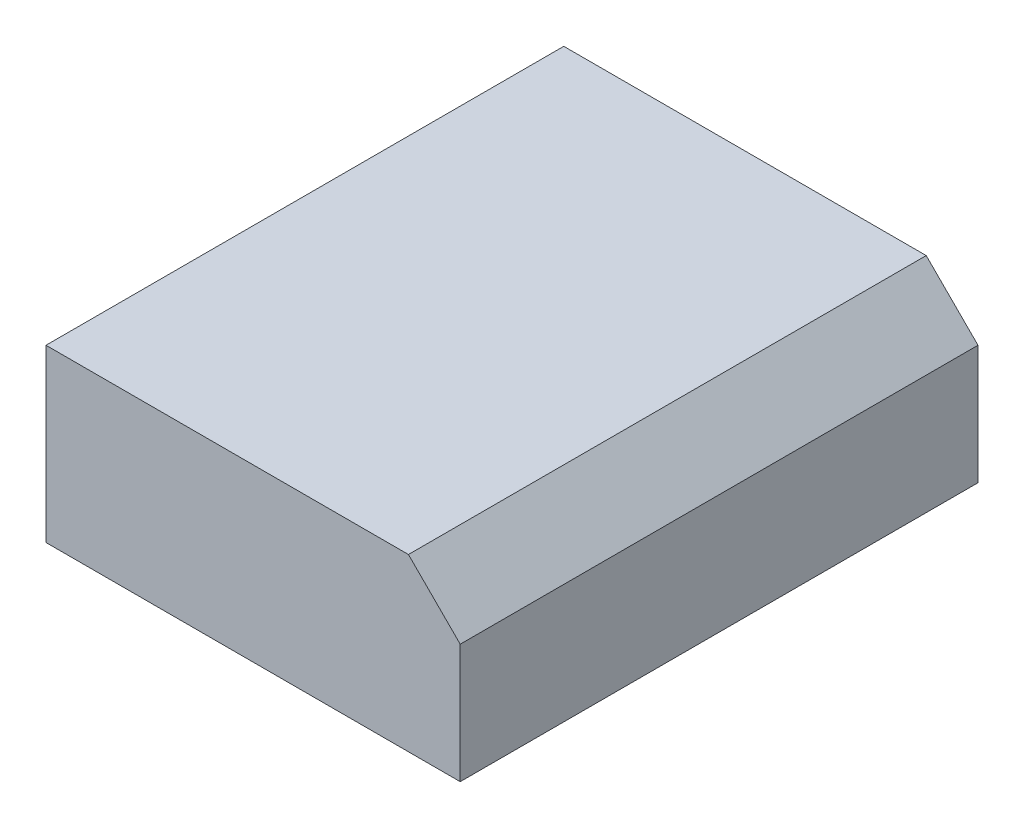
ISO-10303-21;
HEADER;
FILE_DESCRIPTION(('STEP AP214'),'2;1');
FILE_NAME('part.step','',(''),(''),'','','');
FILE_SCHEMA(('AUTOMOTIVE_DESIGN { 1 0 10303 214 1 1 1 1 }'));
ENDSEC;
DATA;
#1=APPLICATION_CONTEXT('core data for automotive mechanical design processes');
#2=APPLICATION_PROTOCOL_DEFINITION('international standard','automotive_design',2000,#1);
#3=PRODUCT_CONTEXT('',#1,'mechanical');
#4=PRODUCT('Part','Part','',(#3));
#5=PRODUCT_RELATED_PRODUCT_CATEGORY('part','',(#4));
#6=PRODUCT_DEFINITION_FORMATION('','',#4);
#7=PRODUCT_DEFINITION_CONTEXT('part definition',#1,'design');
#8=PRODUCT_DEFINITION('design','',#6,#7);
#9=PRODUCT_DEFINITION_SHAPE('','',#8);
#10=(LENGTH_UNIT() NAMED_UNIT(*) SI_UNIT(.MILLI.,.METRE.));
#11=(NAMED_UNIT(*) PLANE_ANGLE_UNIT() SI_UNIT($,.RADIAN.));
#12=(NAMED_UNIT(*) SI_UNIT($,.STERADIAN.) SOLID_ANGLE_UNIT());
#13=UNCERTAINTY_MEASURE_WITH_UNIT(LENGTH_MEASURE(1.E-05),#10,'distance_accuracy_value','');
#14=(GEOMETRIC_REPRESENTATION_CONTEXT(3) GLOBAL_UNCERTAINTY_ASSIGNED_CONTEXT((#13)) GLOBAL_UNIT_ASSIGNED_CONTEXT((#10,
#11,#12)) REPRESENTATION_CONTEXT('',''));
#15=CARTESIAN_POINT('',(0.,0.,0.));
#16=DIRECTION('',(0.,0.,1.));
#17=DIRECTION('',(1.,0.,0.));
#18=AXIS2_PLACEMENT_3D('',#15,#16,#17);
#19=CARTESIAN_POINT('',(1.5,1.75,-2.5));
#20=DIRECTION('',(-0.707106781186548,-0.707106781186548,0.));
#21=DIRECTION('',(0.707106781186548,-0.707106781186548,0.));
#22=AXIS2_PLACEMENT_3D('',#19,#20,#21);
#23=PLANE('',#22);
#24=DIRECTION('',(0.,0.,1.));
#25=VECTOR('',#24,1.);
#26=CARTESIAN_POINT('',(2.,1.25,2.5));
#27=LINE('',#26,#25);
#28=CARTESIAN_POINT('',(2.,1.25,2.5));
#29=VERTEX_POINT('',#28);
#30=CARTESIAN_POINT('',(2.,1.25,-2.5));
#31=VERTEX_POINT('',#30);
#32=EDGE_CURVE('P0_E78',#29,#31,#27,.F.);
#33=ORIENTED_EDGE('',*,*,#32,.T.);
#34=DIRECTION('',(0.707106781186548,-0.707106781186548,0.));
#35=VECTOR('',#34,1.);
#36=CARTESIAN_POINT('',(1.5,1.75,-2.5));
#37=LINE('',#36,#35);
#38=CARTESIAN_POINT('',(1.5,1.75,-2.5));
#39=VERTEX_POINT('',#38);
#40=EDGE_CURVE('P0_E20',#39,#31,#37,.T.);
#41=ORIENTED_EDGE('',*,*,#40,.F.);
#42=DIRECTION('',(0.,0.,-1.));
#43=VECTOR('',#42,1.);
#44=CARTESIAN_POINT('',(1.5,1.75,-2.5));
#45=LINE('',#44,#43);
#46=CARTESIAN_POINT('',(1.5,1.75,2.5));
#47=VERTEX_POINT('',#46);
#48=EDGE_CURVE('P0_E73',#39,#47,#45,.F.);
#49=ORIENTED_EDGE('',*,*,#48,.T.);
#50=DIRECTION('',(0.707106781186548,-0.707106781186548,0.));
#51=VECTOR('',#50,1.);
#52=CARTESIAN_POINT('',(1.5,1.75,2.5));
#53=LINE('',#52,#51);
#54=EDGE_CURVE('P0_E62',#29,#47,#53,.F.);
#55=ORIENTED_EDGE('',*,*,#54,.F.);
#56=EDGE_LOOP('',(#33,#41,#49,#55));
#57=FACE_BOUND('',#56,.T.);
#58=ADVANCED_FACE('P0_F17',(#57),#23,.F.);
#59=CARTESIAN_POINT('',(2.,1.75,-2.5));
#60=DIRECTION('',(0.,-1.,0.));
#61=DIRECTION('',(0.,0.,-1.));
#62=AXIS2_PLACEMENT_3D('',#59,#60,#61);
#63=PLANE('',#62);
#64=ORIENTED_EDGE('',*,*,#48,.F.);
#65=DIRECTION('',(1.,0.,0.));
#66=VECTOR('',#65,1.);
#67=CARTESIAN_POINT('',(-2.,1.75,-2.5));
#68=LINE('',#67,#66);
#69=CARTESIAN_POINT('',(-2.,1.75,-2.5));
#70=VERTEX_POINT('',#69);
#71=EDGE_CURVE('P0_E93',#39,#70,#68,.F.);
#72=ORIENTED_EDGE('',*,*,#71,.T.);
#73=DIRECTION('',(0.,0.,-1.));
#74=VECTOR('',#73,1.);
#75=CARTESIAN_POINT('',(-2.,1.75,2.5));
#76=LINE('',#75,#74);
#77=CARTESIAN_POINT('',(-2.,1.75,2.5));
#78=VERTEX_POINT('',#77);
#79=EDGE_CURVE('P0_E81',#70,#78,#76,.F.);
#80=ORIENTED_EDGE('',*,*,#79,.T.);
#81=DIRECTION('',(-1.,0.,0.));
#82=VECTOR('',#81,1.);
#83=CARTESIAN_POINT('',(-2.,1.75,2.5));
#84=LINE('',#83,#82);
#85=EDGE_CURVE('P0_E69',#78,#47,#84,.F.);
#86=ORIENTED_EDGE('',*,*,#85,.T.);
#87=EDGE_LOOP('',(#64,#72,#80,#86));
#88=FACE_BOUND('',#87,.T.);
#89=ADVANCED_FACE('P0_F80',(#88),#63,.F.);
#90=CARTESIAN_POINT('',(2.,1.75,2.5));
#91=DIRECTION('',(-1.,0.,0.));
#92=DIRECTION('',(0.,0.,1.));
#93=AXIS2_PLACEMENT_3D('',#90,#91,#92);
#94=PLANE('',#93);
#95=ORIENTED_EDGE('',*,*,#32,.F.);
#96=DIRECTION('',(0.,1.,0.));
#97=VECTOR('',#96,1.);
#98=CARTESIAN_POINT('',(2.,1.75,2.5));
#99=LINE('',#98,#97);
#100=CARTESIAN_POINT('',(2.,0.1,2.5));
#101=VERTEX_POINT('',#100);
#102=EDGE_CURVE('P0_E72',#29,#101,#99,.F.);
#103=ORIENTED_EDGE('',*,*,#102,.T.);
#104=DIRECTION('',(0.,0.,-1.));
#105=VECTOR('',#104,1.);
#106=CARTESIAN_POINT('',(2.,0.1,-2.5));
#107=LINE('',#106,#105);
#108=CARTESIAN_POINT('',(2.,0.1,-2.5));
#109=VERTEX_POINT('',#108);
#110=EDGE_CURVE('P0_E95',#109,#101,#107,.F.);
#111=ORIENTED_EDGE('',*,*,#110,.F.);
#112=DIRECTION('',(0.,1.,0.));
#113=VECTOR('',#112,1.);
#114=CARTESIAN_POINT('',(2.,1.75,-2.5));
#115=LINE('',#114,#113);
#116=EDGE_CURVE('P0_E90',#109,#31,#115,.T.);
#117=ORIENTED_EDGE('',*,*,#116,.T.);
#118=EDGE_LOOP('',(#95,#103,#111,#117));
#119=FACE_BOUND('',#118,.T.);
#120=ADVANCED_FACE('P0_F107',(#119),#94,.F.);
#121=CARTESIAN_POINT('',(-2.,1.75,2.5));
#122=DIRECTION('',(0.,0.,-1.));
#123=DIRECTION('',(-1.,0.,0.));
#124=AXIS2_PLACEMENT_3D('',#121,#122,#123);
#125=PLANE('',#124);
#126=ORIENTED_EDGE('',*,*,#54,.T.);
#127=ORIENTED_EDGE('',*,*,#85,.F.);
#128=DIRECTION('',(0.,1.,0.));
#129=VECTOR('',#128,1.);
#130=CARTESIAN_POINT('',(-2.,1.75,2.5));
#131=LINE('',#130,#129);
#132=CARTESIAN_POINT('',(-2.,0.1,2.5));
#133=VERTEX_POINT('',#132);
#134=EDGE_CURVE('P0_E87',#78,#133,#131,.F.);
#135=ORIENTED_EDGE('',*,*,#134,.T.);
#136=DIRECTION('',(1.,0.,0.));
#137=VECTOR('',#136,1.);
#138=CARTESIAN_POINT('',(2.,0.1,2.5));
#139=LINE('',#138,#137);
#140=EDGE_CURVE('P0_E98',#101,#133,#139,.F.);
#141=ORIENTED_EDGE('',*,*,#140,.F.);
#142=ORIENTED_EDGE('',*,*,#102,.F.);
#143=EDGE_LOOP('',(#126,#127,#135,#141,#142));
#144=FACE_BOUND('',#143,.T.);
#145=ADVANCED_FACE('P0_F67',(#144),#125,.F.);
#146=CARTESIAN_POINT('',(-2.,1.75,2.5));
#147=DIRECTION('',(1.,0.,0.));
#148=DIRECTION('',(0.,0.,-1.));
#149=AXIS2_PLACEMENT_3D('',#146,#147,#148);
#150=PLANE('',#149);
#151=ORIENTED_EDGE('',*,*,#134,.F.);
#152=ORIENTED_EDGE('',*,*,#79,.F.);
#153=DIRECTION('',(0.,1.,0.));
#154=VECTOR('',#153,1.);
#155=CARTESIAN_POINT('',(-2.,1.75,-2.5));
#156=LINE('',#155,#154);
#157=CARTESIAN_POINT('',(-2.,0.1,-2.5));
#158=VERTEX_POINT('',#157);
#159=EDGE_CURVE('P0_E35',#70,#158,#156,.F.);
#160=ORIENTED_EDGE('',*,*,#159,.T.);
#161=DIRECTION('',(0.,0.,-1.));
#162=VECTOR('',#161,1.);
#163=CARTESIAN_POINT('',(-2.,0.1,-2.5));
#164=LINE('',#163,#162);
#165=EDGE_CURVE('P0_E26',#133,#158,#164,.T.);
#166=ORIENTED_EDGE('',*,*,#165,.F.);
#167=EDGE_LOOP('',(#151,#152,#160,#166));
#168=FACE_BOUND('',#167,.T.);
#169=ADVANCED_FACE('P0_F104',(#168),#150,.F.);
#170=CARTESIAN_POINT('',(-2.,1.75,-2.5));
#171=DIRECTION('',(0.,0.,1.));
#172=DIRECTION('',(1.,0.,0.));
#173=AXIS2_PLACEMENT_3D('',#170,#171,#172);
#174=PLANE('',#173);
#175=ORIENTED_EDGE('',*,*,#40,.T.);
#176=ORIENTED_EDGE('',*,*,#116,.F.);
#177=DIRECTION('',(1.,0.,0.));
#178=VECTOR('',#177,1.);
#179=CARTESIAN_POINT('',(2.,0.1,-2.5));
#180=LINE('',#179,#178);
#181=EDGE_CURVE('P0_E11',#158,#109,#180,.T.);
#182=ORIENTED_EDGE('',*,*,#181,.F.);
#183=ORIENTED_EDGE('',*,*,#159,.F.);
#184=ORIENTED_EDGE('',*,*,#71,.F.);
#185=EDGE_LOOP('',(#175,#176,#182,#183,#184));
#186=FACE_BOUND('',#185,.T.);
#187=ADVANCED_FACE('P0_F109',(#186),#174,.F.);
#188=CARTESIAN_POINT('',(2.,0.1,-2.5));
#189=DIRECTION('',(0.,-1.,0.));
#190=DIRECTION('',(0.,0.,-1.));
#191=AXIS2_PLACEMENT_3D('',#188,#189,#190);
#192=PLANE('',#191);
#193=ORIENTED_EDGE('',*,*,#165,.T.);
#194=ORIENTED_EDGE('',*,*,#181,.T.);
#195=ORIENTED_EDGE('',*,*,#110,.T.);
#196=ORIENTED_EDGE('',*,*,#140,.T.);
#197=EDGE_LOOP('',(#193,#194,#195,#196));
#198=FACE_BOUND('',#197,.T.);
#199=ADVANCED_FACE('P0_F103',(#198),#192,.T.);
#200=CLOSED_SHELL('',(#58,#89,#120,#145,#169,#187,#199));
#201=MANIFOLD_SOLID_BREP('P0_B1',#200);
#202=CARTESIAN_POINT('',(1.205,0.,-1.55));
#203=DIRECTION('',(0.,-1.,0.));
#204=DIRECTION('',(0.,0.,-1.));
#205=AXIS2_PLACEMENT_3D('',#202,#203,#204);
#206=PLANE('',#205);
#207=DIRECTION('',(0.,0.,-1.));
#208=VECTOR('',#207,1.);
#209=CARTESIAN_POINT('',(-1.205,0.,1.55));
#210=LINE('',#209,#208);
#211=CARTESIAN_POINT('',(-1.205,0.,1.55));
#212=VERTEX_POINT('',#211);
#213=CARTESIAN_POINT('',(-1.205,0.,-1.55));
#214=VERTEX_POINT('',#213);
#215=EDGE_CURVE('P1_E55',#212,#214,#210,.T.);
#216=ORIENTED_EDGE('',*,*,#215,.T.);
#217=DIRECTION('',(1.,0.,0.));
#218=VECTOR('',#217,1.);
#219=CARTESIAN_POINT('',(-1.205,0.,-1.55));
#220=LINE('',#219,#218);
#221=CARTESIAN_POINT('',(1.205,0.,-1.55));
#222=VERTEX_POINT('',#221);
#223=EDGE_CURVE('P1_E76',#214,#222,#220,.T.);
#224=ORIENTED_EDGE('',*,*,#223,.T.);
#225=DIRECTION('',(0.,0.,1.));
#226=VECTOR('',#225,1.);
#227=CARTESIAN_POINT('',(1.205,0.,1.55));
#228=LINE('',#227,#226);
#229=CARTESIAN_POINT('',(1.205,0.,1.55));
#230=VERTEX_POINT('',#229);
#231=EDGE_CURVE('P1_E58',#222,#230,#228,.T.);
#232=ORIENTED_EDGE('',*,*,#231,.T.);
#233=DIRECTION('',(-1.,0.,0.));
#234=VECTOR('',#233,1.);
#235=CARTESIAN_POINT('',(-1.205,0.,1.55));
#236=LINE('',#235,#234);
#237=EDGE_CURVE('P1_E20',#230,#212,#236,.T.);
#238=ORIENTED_EDGE('',*,*,#237,.T.);
#239=EDGE_LOOP('',(#216,#224,#232,#238));
#240=FACE_BOUND('',#239,.T.);
#241=ADVANCED_FACE('P1_F17',(#240),#206,.T.);
#242=CARTESIAN_POINT('',(-1.205,0.1,1.55));
#243=DIRECTION('',(0.,0.,-1.));
#244=DIRECTION('',(-1.,0.,0.));
#245=AXIS2_PLACEMENT_3D('',#242,#243,#244);
#246=PLANE('',#245);
#247=DIRECTION('',(0.,1.,0.));
#248=VECTOR('',#247,1.);
#249=CARTESIAN_POINT('',(1.205,0.1,1.55));
#250=LINE('',#249,#248);
#251=CARTESIAN_POINT('',(1.205,0.1,1.55));
#252=VERTEX_POINT('',#251);
#253=EDGE_CURVE('P1_E78',#230,#252,#250,.T.);
#254=ORIENTED_EDGE('',*,*,#253,.T.);
#255=DIRECTION('',(1.,0.,0.));
#256=VECTOR('',#255,1.);
#257=CARTESIAN_POINT('',(1.205,0.1,1.55));
#258=LINE('',#257,#256);
#259=CARTESIAN_POINT('',(-1.205,0.1,1.55));
#260=VERTEX_POINT('',#259);
#261=EDGE_CURVE('P1_E73',#252,#260,#258,.F.);
#262=ORIENTED_EDGE('',*,*,#261,.T.);
#263=DIRECTION('',(0.,1.,0.));
#264=VECTOR('',#263,1.);
#265=CARTESIAN_POINT('',(-1.205,0.1,1.55));
#266=LINE('',#265,#264);
#267=EDGE_CURVE('P1_E63',#260,#212,#266,.F.);
#268=ORIENTED_EDGE('',*,*,#267,.T.);
#269=ORIENTED_EDGE('',*,*,#237,.F.);
#270=EDGE_LOOP('',(#254,#262,#268,#269));
#271=FACE_BOUND('',#270,.T.);
#272=ADVANCED_FACE('P1_F72',(#271),#246,.F.);
#273=CARTESIAN_POINT('',(-1.205,0.1,1.55));
#274=DIRECTION('',(1.,0.,0.));
#275=DIRECTION('',(0.,0.,-1.));
#276=AXIS2_PLACEMENT_3D('',#273,#274,#275);
#277=PLANE('',#276);
#278=ORIENTED_EDGE('',*,*,#267,.F.);
#279=DIRECTION('',(0.,0.,-1.));
#280=VECTOR('',#279,1.);
#281=CARTESIAN_POINT('',(-1.205,0.1,-1.55));
#282=LINE('',#281,#280);
#283=CARTESIAN_POINT('',(-1.205,0.1,-1.55));
#284=VERTEX_POINT('',#283);
#285=EDGE_CURVE('P1_E83',#260,#284,#282,.T.);
#286=ORIENTED_EDGE('',*,*,#285,.T.);
#287=DIRECTION('',(0.,1.,0.));
#288=VECTOR('',#287,1.);
#289=CARTESIAN_POINT('',(-1.205,0.1,-1.55));
#290=LINE('',#289,#288);
#291=EDGE_CURVE('P1_E69',#284,#214,#290,.F.);
#292=ORIENTED_EDGE('',*,*,#291,.T.);
#293=ORIENTED_EDGE('',*,*,#215,.F.);
#294=EDGE_LOOP('',(#278,#286,#292,#293));
#295=FACE_BOUND('',#294,.T.);
#296=ADVANCED_FACE('P1_F66',(#295),#277,.F.);
#297=CARTESIAN_POINT('',(-1.205,0.1,-1.55));
#298=DIRECTION('',(0.,0.,1.));
#299=DIRECTION('',(1.,0.,0.));
#300=AXIS2_PLACEMENT_3D('',#297,#298,#299);
#301=PLANE('',#300);
#302=ORIENTED_EDGE('',*,*,#291,.F.);
#303=DIRECTION('',(1.,0.,0.));
#304=VECTOR('',#303,1.);
#305=CARTESIAN_POINT('',(1.205,0.1,-1.55));
#306=LINE('',#305,#304);
#307=CARTESIAN_POINT('',(1.205,0.1,-1.55));
#308=VERTEX_POINT('',#307);
#309=EDGE_CURVE('P1_E26',#284,#308,#306,.T.);
#310=ORIENTED_EDGE('',*,*,#309,.T.);
#311=DIRECTION('',(0.,1.,0.));
#312=VECTOR('',#311,1.);
#313=CARTESIAN_POINT('',(1.205,0.1,-1.55));
#314=LINE('',#313,#312);
#315=EDGE_CURVE('P1_E34',#308,#222,#314,.F.);
#316=ORIENTED_EDGE('',*,*,#315,.T.);
#317=ORIENTED_EDGE('',*,*,#223,.F.);
#318=EDGE_LOOP('',(#302,#310,#316,#317));
#319=FACE_BOUND('',#318,.T.);
#320=ADVANCED_FACE('P1_F88',(#319),#301,.F.);
#321=CARTESIAN_POINT('',(1.205,0.1,1.55));
#322=DIRECTION('',(-1.,0.,0.));
#323=DIRECTION('',(0.,0.,1.));
#324=AXIS2_PLACEMENT_3D('',#321,#322,#323);
#325=PLANE('',#324);
#326=ORIENTED_EDGE('',*,*,#315,.F.);
#327=DIRECTION('',(0.,0.,-1.));
#328=VECTOR('',#327,1.);
#329=CARTESIAN_POINT('',(1.205,0.1,-1.55));
#330=LINE('',#329,#328);
#331=EDGE_CURVE('P1_E11',#308,#252,#330,.F.);
#332=ORIENTED_EDGE('',*,*,#331,.T.);
#333=ORIENTED_EDGE('',*,*,#253,.F.);
#334=ORIENTED_EDGE('',*,*,#231,.F.);
#335=EDGE_LOOP('',(#326,#332,#333,#334));
#336=FACE_BOUND('',#335,.T.);
#337=ADVANCED_FACE('P1_F91',(#336),#325,.F.);
#338=CARTESIAN_POINT('',(1.205,0.1,-1.55));
#339=DIRECTION('',(0.,-1.,0.));
#340=DIRECTION('',(0.,0.,-1.));
#341=AXIS2_PLACEMENT_3D('',#338,#339,#340);
#342=PLANE('',#341);
#343=ORIENTED_EDGE('',*,*,#309,.F.);
#344=ORIENTED_EDGE('',*,*,#285,.F.);
#345=ORIENTED_EDGE('',*,*,#261,.F.);
#346=ORIENTED_EDGE('',*,*,#331,.F.);
#347=EDGE_LOOP('',(#343,#344,#345,#346));
#348=FACE_BOUND('',#347,.T.);
#349=ADVANCED_FACE('P1_F90',(#348),#342,.F.);
#350=CLOSED_SHELL('',(#241,#272,#296,#320,#337,#349));
#351=MANIFOLD_SOLID_BREP('P1_B1',#350);
#352=ADVANCED_BREP_SHAPE_REPRESENTATION('',(#18,#201,#351),#14);
#353=SHAPE_DEFINITION_REPRESENTATION(#9,#352);
ENDSEC;
END-ISO-10303-21;
